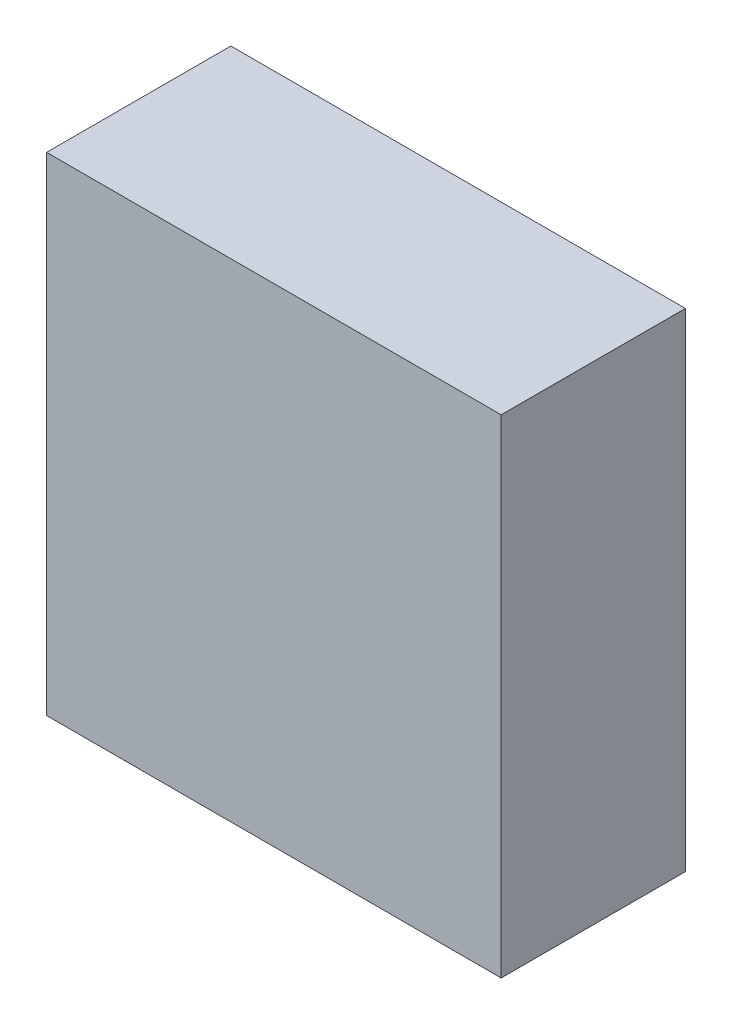
ISO-10303-21;
HEADER;
FILE_DESCRIPTION(('STEP AP214'),'2;1');
FILE_NAME('part.step','',(''),(''),'','','');
FILE_SCHEMA(('AUTOMOTIVE_DESIGN { 1 0 10303 214 1 1 1 1 }'));
ENDSEC;
DATA;
#1=APPLICATION_CONTEXT('core data for automotive mechanical design processes');
#2=APPLICATION_PROTOCOL_DEFINITION('international standard','automotive_design',2000,#1);
#3=PRODUCT_CONTEXT('',#1,'mechanical');
#4=PRODUCT('Part','Part','',(#3));
#5=PRODUCT_RELATED_PRODUCT_CATEGORY('part','',(#4));
#6=PRODUCT_DEFINITION_FORMATION('','',#4);
#7=PRODUCT_DEFINITION_CONTEXT('part definition',#1,'design');
#8=PRODUCT_DEFINITION('design','',#6,#7);
#9=PRODUCT_DEFINITION_SHAPE('','',#8);
#10=(LENGTH_UNIT() NAMED_UNIT(*) SI_UNIT(.MILLI.,.METRE.));
#11=(NAMED_UNIT(*) PLANE_ANGLE_UNIT() SI_UNIT($,.RADIAN.));
#12=(NAMED_UNIT(*) SI_UNIT($,.STERADIAN.) SOLID_ANGLE_UNIT());
#13=UNCERTAINTY_MEASURE_WITH_UNIT(LENGTH_MEASURE(1.E-05),#10,'distance_accuracy_value','');
#14=(GEOMETRIC_REPRESENTATION_CONTEXT(3) GLOBAL_UNCERTAINTY_ASSIGNED_CONTEXT((#13)) GLOBAL_UNIT_ASSIGNED_CONTEXT((#10,
#11,#12)) REPRESENTATION_CONTEXT('',''));
#15=CARTESIAN_POINT('',(0.,0.,0.));
#16=DIRECTION('',(0.,0.,1.));
#17=DIRECTION('',(1.,0.,0.));
#18=AXIS2_PLACEMENT_3D('',#15,#16,#17);
#19=CARTESIAN_POINT('',(-1.6000139195495,3.26999076341336,-4.61112093925476));
#20=DIRECTION('',(-1.,8.74227765734759E-08,0.));
#21=DIRECTION('',(-8.74227765734759E-08,-1.,0.));
#22=AXIS2_PLACEMENT_3D('',#19,#20,#21);
#23=PLANE('',#22);
#24=DIRECTION('',(-8.7422776579626E-08,-0.999999999999996,0.));
#25=VECTOR('',#24,1.);
#26=CARTESIAN_POINT('',(-1.6000139195495,3.26999076341336,-4.61112093925476));
#27=LINE('',#26,#25);
#28=CARTESIAN_POINT('',(-1.6000139195495,3.26999076341336,-4.61112093925476));
#29=VERTEX_POINT('',#28);
#30=CARTESIAN_POINT('',(-1.60001449129459,-3.27001015211398,-4.61112093925476));
#31=VERTEX_POINT('',#30);
#32=EDGE_CURVE('E11',#29,#31,#27,.T.);
#33=ORIENTED_EDGE('',*,*,#32,.T.);
#34=DIRECTION('',(0.,0.,1.));
#35=VECTOR('',#34,1.);
#36=CARTESIAN_POINT('',(-1.60001449129454,-3.27001015211398,-4.61112093925476));
#37=LINE('',#36,#35);
#38=CARTESIAN_POINT('',(-1.60001449129459,-3.27001015211398,-2.14112091064453));
#39=VERTEX_POINT('',#38);
#40=EDGE_CURVE('E88',#31,#39,#37,.T.);
#41=ORIENTED_EDGE('',*,*,#40,.T.);
#42=DIRECTION('',(-8.7422776579626E-08,-0.999999999999996,0.));
#43=VECTOR('',#42,1.);
#44=CARTESIAN_POINT('',(-1.6000139195495,3.26999076341336,-2.14112091064453));
#45=LINE('',#44,#43);
#46=CARTESIAN_POINT('',(-1.6000139195495,3.26999076341336,-2.14112091064453));
#47=VERTEX_POINT('',#46);
#48=EDGE_CURVE('E83',#47,#39,#45,.T.);
#49=ORIENTED_EDGE('',*,*,#48,.F.);
#50=DIRECTION('',(0.,0.,1.));
#51=VECTOR('',#50,1.);
#52=CARTESIAN_POINT('',(-1.6000139195495,3.26999076341335,-4.61112093925476));
#53=LINE('',#52,#51);
#54=EDGE_CURVE('E72',#29,#47,#53,.T.);
#55=ORIENTED_EDGE('',*,*,#54,.F.);
#56=EDGE_LOOP('',(#33,#41,#49,#55));
#57=FACE_BOUND('',#56,.T.);
#58=ADVANCED_FACE('F17',(#57),#23,.T.);
#59=CARTESIAN_POINT('',(-1.60001449129459,-3.27001015211398,-4.61112093925476));
#60=DIRECTION('',(-8.74227765734759E-08,-1.,0.));
#61=DIRECTION('',(1.,-8.74227765734759E-08,0.));
#62=AXIS2_PLACEMENT_3D('',#59,#60,#61);
#63=PLANE('',#62);
#64=DIRECTION('',(0.999999999999996,-8.74227766065619E-08,0.));
#65=VECTOR('',#64,1.);
#66=CARTESIAN_POINT('',(-1.60001449129459,-3.27001015211398,-4.61112093925476));
#67=LINE('',#66,#65);
#68=CARTESIAN_POINT('',(4.49498672940854,-3.27001068495592,-4.61112093925476));
#69=VERTEX_POINT('',#68);
#70=EDGE_CURVE('E24',#31,#69,#67,.T.);
#71=ORIENTED_EDGE('',*,*,#70,.T.);
#72=DIRECTION('',(0.,0.,1.));
#73=VECTOR('',#72,1.);
#74=CARTESIAN_POINT('',(4.49498672940854,-3.27001068495591,-4.61112093925476));
#75=LINE('',#74,#73);
#76=CARTESIAN_POINT('',(4.49498672940854,-3.27001068495592,-2.14112091064453));
#77=VERTEX_POINT('',#76);
#78=EDGE_CURVE('E85',#69,#77,#75,.T.);
#79=ORIENTED_EDGE('',*,*,#78,.T.);
#80=DIRECTION('',(0.999999999999996,-8.74227766065619E-08,0.));
#81=VECTOR('',#80,1.);
#82=CARTESIAN_POINT('',(-1.60001449129459,-3.27001015211398,-2.14112091064453));
#83=LINE('',#82,#81);
#84=EDGE_CURVE('E66',#39,#77,#83,.T.);
#85=ORIENTED_EDGE('',*,*,#84,.F.);
#86=ORIENTED_EDGE('',*,*,#40,.F.);
#87=EDGE_LOOP('',(#71,#79,#85,#86));
#88=FACE_BOUND('',#87,.T.);
#89=ADVANCED_FACE('F89',(#88),#63,.T.);
#90=CARTESIAN_POINT('',(4.49498672940854,-3.27001068495592,-4.61112093925476));
#91=DIRECTION('',(1.,-8.74227765734759E-08,0.));
#92=DIRECTION('',(8.74227765734759E-08,1.,0.));
#93=AXIS2_PLACEMENT_3D('',#90,#91,#92);
#94=PLANE('',#93);
#95=DIRECTION('',(8.7422776579626E-08,0.999999999999996,0.));
#96=VECTOR('',#95,1.);
#97=CARTESIAN_POINT('',(4.49498672940854,-3.27001068495592,-4.61112093925476));
#98=LINE('',#97,#96);
#99=CARTESIAN_POINT('',(4.49498730115363,3.26999023057142,-4.61112093925476));
#100=VERTEX_POINT('',#99);
#101=EDGE_CURVE('E62',#69,#100,#98,.T.);
#102=ORIENTED_EDGE('',*,*,#101,.T.);
#103=DIRECTION('',(0.,0.,1.));
#104=VECTOR('',#103,1.);
#105=CARTESIAN_POINT('',(4.49498730115358,3.26999023057142,-4.61112093925476));
#106=LINE('',#105,#104);
#107=CARTESIAN_POINT('',(4.49498730115363,3.26999023057142,-2.14112091064453));
#108=VERTEX_POINT('',#107);
#109=EDGE_CURVE('E55',#100,#108,#106,.T.);
#110=ORIENTED_EDGE('',*,*,#109,.T.);
#111=DIRECTION('',(8.7422776579626E-08,0.999999999999996,0.));
#112=VECTOR('',#111,1.);
#113=CARTESIAN_POINT('',(4.49498672940854,-3.27001068495592,-2.14112091064453));
#114=LINE('',#113,#112);
#115=EDGE_CURVE('E59',#77,#108,#114,.T.);
#116=ORIENTED_EDGE('',*,*,#115,.F.);
#117=ORIENTED_EDGE('',*,*,#78,.F.);
#118=EDGE_LOOP('',(#102,#110,#116,#117));
#119=FACE_BOUND('',#118,.T.);
#120=ADVANCED_FACE('F57',(#119),#94,.T.);
#121=CARTESIAN_POINT('',(4.49498730115363,3.26999023057142,-4.61112093925476));
#122=DIRECTION('',(8.74227765734759E-08,1.,0.));
#123=DIRECTION('',(-1.,8.74227765734759E-08,0.));
#124=AXIS2_PLACEMENT_3D('',#121,#122,#123);
#125=PLANE('',#124);
#126=DIRECTION('',(-0.999999999999996,8.74227766065619E-08,0.));
#127=VECTOR('',#126,1.);
#128=CARTESIAN_POINT('',(4.49498730115363,3.26999023057142,-4.61112093925476));
#129=LINE('',#128,#127);
#130=EDGE_CURVE('E65',#100,#29,#129,.T.);
#131=ORIENTED_EDGE('',*,*,#130,.T.);
#132=ORIENTED_EDGE('',*,*,#54,.T.);
#133=DIRECTION('',(-0.999999999999996,8.74227766065619E-08,0.));
#134=VECTOR('',#133,1.);
#135=CARTESIAN_POINT('',(4.49498730115363,3.26999023057142,-2.14112091064453));
#136=LINE('',#135,#134);
#137=EDGE_CURVE('E70',#108,#47,#136,.T.);
#138=ORIENTED_EDGE('',*,*,#137,.F.);
#139=ORIENTED_EDGE('',*,*,#109,.F.);
#140=EDGE_LOOP('',(#131,#132,#138,#139));
#141=FACE_BOUND('',#140,.T.);
#142=ADVANCED_FACE('F71',(#141),#125,.T.);
#143=CARTESIAN_POINT('',(280.225006103516,92.6749725341797,-2.14112091064453));
#144=DIRECTION('',(0.,0.,1.));
#145=DIRECTION('',(-1.,8.74227765734759E-08,0.));
#146=AXIS2_PLACEMENT_3D('',#143,#144,#145);
#147=PLANE('',#146);
#148=ORIENTED_EDGE('',*,*,#48,.T.);
#149=ORIENTED_EDGE('',*,*,#84,.T.);
#150=ORIENTED_EDGE('',*,*,#115,.T.);
#151=ORIENTED_EDGE('',*,*,#137,.T.);
#152=EDGE_LOOP('',(#148,#149,#150,#151));
#153=FACE_BOUND('',#152,.T.);
#154=ADVANCED_FACE('F76',(#153),#147,.T.);
#155=CARTESIAN_POINT('',(280.225006103516,92.6749725341797,-4.61112093925476));
#156=DIRECTION('',(0.,0.,1.));
#157=DIRECTION('',(-1.,8.74227765734759E-08,0.));
#158=AXIS2_PLACEMENT_3D('',#155,#156,#157);
#159=PLANE('',#158);
#160=ORIENTED_EDGE('',*,*,#130,.F.);
#161=ORIENTED_EDGE('',*,*,#101,.F.);
#162=ORIENTED_EDGE('',*,*,#70,.F.);
#163=ORIENTED_EDGE('',*,*,#32,.F.);
#164=EDGE_LOOP('',(#160,#161,#162,#163));
#165=FACE_BOUND('',#164,.T.);
#166=ADVANCED_FACE('F91',(#165),#159,.F.);
#167=CLOSED_SHELL('',(#58,#89,#120,#142,#154,#166));
#168=MANIFOLD_SOLID_BREP('B1',#167);
#169=ADVANCED_BREP_SHAPE_REPRESENTATION('',(#18,#168),#14);
#170=SHAPE_DEFINITION_REPRESENTATION(#9,#169);
ENDSEC;
END-ISO-10303-21;
